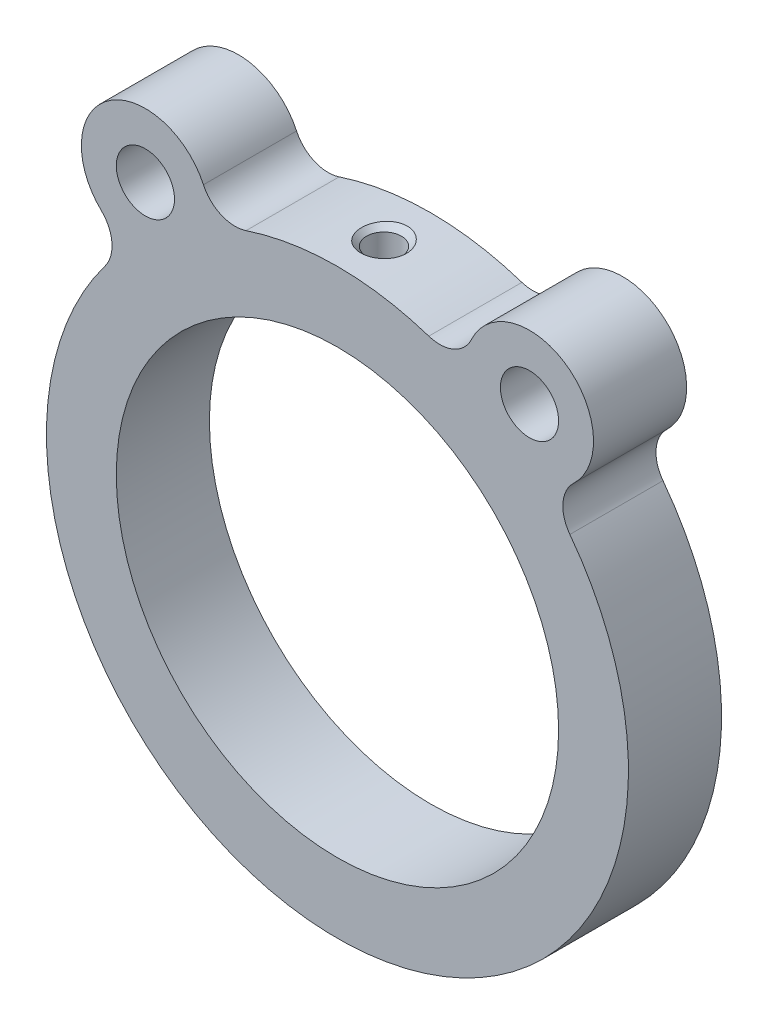
ISO-10303-21;
HEADER;
FILE_DESCRIPTION(('STEP AP214'),'2;1');
FILE_NAME('part.step','',(''),(''),'','','');
FILE_SCHEMA(('AUTOMOTIVE_DESIGN { 1 0 10303 214 1 1 1 1 }'));
ENDSEC;
DATA;
#1=APPLICATION_CONTEXT('core data for automotive mechanical design processes');
#2=APPLICATION_PROTOCOL_DEFINITION('international standard','automotive_design',2000,#1);
#3=PRODUCT_CONTEXT('',#1,'mechanical');
#4=PRODUCT('Part','Part','',(#3));
#5=PRODUCT_RELATED_PRODUCT_CATEGORY('part','',(#4));
#6=PRODUCT_DEFINITION_FORMATION('','',#4);
#7=PRODUCT_DEFINITION_CONTEXT('part definition',#1,'design');
#8=PRODUCT_DEFINITION('design','',#6,#7);
#9=PRODUCT_DEFINITION_SHAPE('','',#8);
#10=(LENGTH_UNIT() NAMED_UNIT(*) SI_UNIT(.MILLI.,.METRE.));
#11=(NAMED_UNIT(*) PLANE_ANGLE_UNIT() SI_UNIT($,.RADIAN.));
#12=(NAMED_UNIT(*) SI_UNIT($,.STERADIAN.) SOLID_ANGLE_UNIT());
#13=UNCERTAINTY_MEASURE_WITH_UNIT(LENGTH_MEASURE(1.E-05),#10,'distance_accuracy_value','');
#14=(GEOMETRIC_REPRESENTATION_CONTEXT(3) GLOBAL_UNCERTAINTY_ASSIGNED_CONTEXT((#13)) GLOBAL_UNIT_ASSIGNED_CONTEXT((#10,
#11,#12)) REPRESENTATION_CONTEXT('',''));
#15=CARTESIAN_POINT('',(0.,0.,0.));
#16=DIRECTION('',(0.,0.,1.));
#17=DIRECTION('',(1.,0.,0.));
#18=AXIS2_PLACEMENT_3D('',#15,#16,#17);
#19=CARTESIAN_POINT('',(-8.79240471556152,26.5837096605754,-4.));
#20=DIRECTION('',(0.,0.,1.));
#21=DIRECTION('',(1.,0.,0.));
#22=AXIS2_PLACEMENT_3D('',#19,#20,#21);
#23=CYLINDRICAL_SURFACE('',#22,3.);
#24=DIRECTION('',(0.,0.,1.));
#25=VECTOR('',#24,1.);
#26=CARTESIAN_POINT('',(-11.5127324630104,25.3188709568429,-4.));
#27=LINE('',#26,#25);
#28=CARTESIAN_POINT('',(-11.5127324630104,25.3188709568429,-4.));
#29=VERTEX_POINT('',#28);
#30=CARTESIAN_POINT('',(-11.5127324630104,25.3188709568429,4.));
#31=VERTEX_POINT('',#30);
#32=EDGE_CURVE('E120',#29,#31,#27,.T.);
#33=ORIENTED_EDGE('',*,*,#32,.T.);
#34=CARTESIAN_POINT('',(-8.79240471556152,26.5837096605754,4.));
#35=DIRECTION('',(0.,0.,1.));
#36=DIRECTION('',(1.,0.,0.));
#37=AXIS2_PLACEMENT_3D('',#34,#35,#36);
#38=CIRCLE('',#37,3.);
#39=CARTESIAN_POINT('',(-7.85036135317993,23.7354550540852,4.));
#40=VERTEX_POINT('',#39);
#41=EDGE_CURVE('E123',#31,#40,#38,.T.);
#42=ORIENTED_EDGE('',*,*,#41,.T.);
#43=DIRECTION('',(0.,0.,1.));
#44=VECTOR('',#43,1.);
#45=CARTESIAN_POINT('',(-7.85036135317993,23.7354550540852,-4.));
#46=LINE('',#45,#44);
#47=CARTESIAN_POINT('',(-7.85036135317993,23.7354550540852,-4.));
#48=VERTEX_POINT('',#47);
#49=EDGE_CURVE('E61',#48,#40,#46,.T.);
#50=ORIENTED_EDGE('',*,*,#49,.F.);
#51=CARTESIAN_POINT('',(-8.79240471556152,26.5837096605754,-4.));
#52=DIRECTION('',(0.,0.,1.));
#53=DIRECTION('',(1.,0.,0.));
#54=AXIS2_PLACEMENT_3D('',#51,#52,#53);
#55=CIRCLE('',#54,3.);
#56=EDGE_CURVE('E68',#29,#48,#55,.T.);
#57=ORIENTED_EDGE('',*,*,#56,.F.);
#58=EDGE_LOOP('',(#33,#42,#50,#57));
#59=FACE_BOUND('',#58,.T.);
#60=ADVANCED_FACE('F47',(#59),#23,.F.);
#61=CARTESIAN_POINT('',(0.,0.,-4.));
#62=DIRECTION('',(0.,0.,1.));
#63=DIRECTION('',(1.,0.,0.));
#64=AXIS2_PLACEMENT_3D('',#61,#62,#63);
#65=CYLINDRICAL_SURFACE('',#64,25.);
#66=CARTESIAN_POINT('',(-1.38843010974731,24.9614154671045,-1.38542860972688));
#67=CARTESIAN_POINT('',(-1.45429793454577,24.9577518223364,-1.31422853395466));
#68=CARTESIAN_POINT('',(-1.51491865516553,24.9541184918379,-1.23814035663589));
#69=CARTESIAN_POINT('',(-1.62454468414856,24.9472218705402,-1.07793964803592));
#70=CARTESIAN_POINT('',(-1.67353970891014,24.9439589086744,-0.99382010408581));
#71=CARTESIAN_POINT('',(-1.7657849281638,24.9376118014175,-0.805587915157327));
#72=CARTESIAN_POINT('',(-1.80690031661354,24.9346375942488,-0.70041756795328));
#73=CARTESIAN_POINT('',(-1.87140051363912,24.9298798807674,-0.484739942176894));
#74=CARTESIAN_POINT('',(-1.89477953577936,24.9280967630666,-0.374230934379203));
#75=CARTESIAN_POINT('',(-1.92363344715744,24.925887257572,-0.148188546922309));
#76=CARTESIAN_POINT('',(-1.92866685393591,24.9254943307857,-0.0325982116153125));
#77=CARTESIAN_POINT('',(-1.91948554378553,24.9262029636298,0.19781071683945));
#78=CARTESIAN_POINT('',(-1.90527025447947,24.9273045677012,0.312629286936056));
#79=CARTESIAN_POINT('',(-1.85771950616719,24.9308934345965,0.539192716934517));
#80=CARTESIAN_POINT('',(-1.82423084304796,24.933391795643,0.650905338745798));
#81=CARTESIAN_POINT('',(-1.73879665932032,24.9394949769286,0.867016586301364));
#82=CARTESIAN_POINT('',(-1.68685124803656,24.9430997906137,0.971415255363921));
#83=CARTESIAN_POINT('',(-1.56646899928733,24.9509470303338,1.16856366272785));
#84=CARTESIAN_POINT('',(-1.49822874049673,24.9551816447478,1.26143358706966));
#85=CARTESIAN_POINT('',(-1.34668012361719,24.9638176798685,1.43394194572168));
#86=CARTESIAN_POINT('',(-1.26337411351827,24.9682190744982,1.51358243812703));
#87=CARTESIAN_POINT('',(-1.0866525267161,24.976524220639,1.65475876482627));
#88=CARTESIAN_POINT('',(-0.993612363611554,24.980438895945,1.71676354411993));
#89=CARTESIAN_POINT('',(-0.798097982720414,24.9874485324203,1.8235619610644));
#90=CARTESIAN_POINT('',(-0.695626135538064,24.9905436988148,1.86835990899744));
#91=CARTESIAN_POINT('',(-0.488371265812186,24.9954360022362,1.93771446067499));
#92=CARTESIAN_POINT('',(-0.383825887264937,24.9972781891824,1.96297862427251));
#93=CARTESIAN_POINT('',(-0.17193501648651,24.999633013644,1.99510537976769));
#94=CARTESIAN_POINT('',(-0.0645900493297553,25.0001458986897,2.00197139760662));
#95=CARTESIAN_POINT('',(0.146800890801465,24.9997865920041,1.99711715735622));
#96=CARTESIAN_POINT('',(0.250858569754043,24.9989509333938,1.98588714699941));
#97=CARTESIAN_POINT('',(0.455598629109989,24.9960579997683,1.94616252235443));
#98=CARTESIAN_POINT('',(0.556281096751086,24.9940007563525,1.91766835464964));
#99=CARTESIAN_POINT('',(0.751562950408507,24.98889175667,1.84437586695549));
#100=CARTESIAN_POINT('',(0.846158085927066,24.9858393143344,1.79956629697867));
#101=CARTESIAN_POINT('',(1.02673399151959,24.9790711256239,1.69511395502983));
#102=CARTESIAN_POINT('',(1.11271381133365,24.9753553062049,1.6354695493126));
#103=CARTESIAN_POINT('',(1.27611917377163,24.9675469140965,1.50140190212929));
#104=CARTESIAN_POINT('',(1.35325594396933,24.9634469435824,1.42662739853191));
#105=CARTESIAN_POINT('',(1.49442443372117,24.9553943538353,1.26558982571308));
#106=CARTESIAN_POINT('',(1.55845386369849,24.9514417604444,1.17932475366761));
#107=CARTESIAN_POINT('',(1.67409890424333,24.9439549003817,0.994320404300172));
#108=CARTESIAN_POINT('',(1.72516531080806,24.9404416156022,0.895236885985037));
#109=CARTESIAN_POINT('',(1.81052972493888,24.9343903202022,0.690065339602644));
#110=CARTESIAN_POINT('',(1.84482500038189,24.9318524685002,0.583976173464141));
#111=CARTESIAN_POINT('',(1.89668265881625,24.9279622283365,0.36433872854194));
#112=CARTESIAN_POINT('',(1.91370355738033,24.9266483023783,0.250661676953384));
#113=CARTESIAN_POINT('',(1.92876691781171,24.9254872653056,0.0220452715314571));
#114=CARTESIAN_POINT('',(1.9268074072236,24.9256403066391,-0.092894212254839));
#115=CARTESIAN_POINT('',(1.9037883474786,24.9274091104999,-0.322471285245161));
#116=CARTESIAN_POINT('',(1.88246144233827,24.9290453471264,-0.437082056996947));
#117=CARTESIAN_POINT('',(1.82081934865818,24.9336231674514,-0.661061575031441));
#118=CARTESIAN_POINT('',(1.78050382010938,24.9365647745237,-0.770430227410472));
#119=CARTESIAN_POINT('',(1.68209705613917,24.9433950826763,-0.980136546399163));
#120=CARTESIAN_POINT('',(1.62409993865791,24.9472787474008,-1.08051847442439));
#121=CARTESIAN_POINT('',(1.49168364688542,24.9555457484372,-1.26978612161105));
#122=CARTESIAN_POINT('',(1.41726622372298,24.9599290314437,-1.35867306504282));
#123=CARTESIAN_POINT('',(1.25597324139614,24.9685577825635,-1.52000845237909));
#124=CARTESIAN_POINT('',(1.16944742124023,24.9728039968136,-1.59280616929048));
#125=CARTESIAN_POINT('',(0.984983849012787,24.9807586981632,-1.72217254679717));
#126=CARTESIAN_POINT('',(0.887048762753952,24.9844673104226,-1.77874498782987));
#127=CARTESIAN_POINT('',(0.686470078103515,24.9907670923137,-1.87180900069342));
#128=CARTESIAN_POINT('',(0.584139005661903,24.9933948277215,-1.90897172771205));
#129=CARTESIAN_POINT('',(0.374561901245703,24.997413253192,-1.96497222038236));
#130=CARTESIAN_POINT('',(0.267317089980449,24.9988042487617,-1.98381451176948));
#131=CARTESIAN_POINT('',(0.0547181397297122,25.0001587942169,-2.0021622812772));
#132=CARTESIAN_POINT('',(-0.0505833682825598,25.0001674767928,-2.00227914767056));
#133=CARTESIAN_POINT('',(-0.259690595456118,24.9988698146133,-1.98470333600606));
#134=CARTESIAN_POINT('',(-0.363496217285861,24.9975633846771,-1.96700950433453));
#135=CARTESIAN_POINT('',(-0.565757719942908,24.9938007458487,-1.91467510981907));
#136=CARTESIAN_POINT('',(-0.664251563674998,24.9913544012188,-1.88017982476418));
#137=CARTESIAN_POINT('',(-0.854149060944219,24.9855848763253,-1.79548413881126));
#138=CARTESIAN_POINT('',(-0.945556989738515,24.9822622301869,-1.74529330125301));
#139=CARTESIAN_POINT('',(-1.09746298428397,24.975985532235,-1.64505330905546));
#140=CARTESIAN_POINT('',(-1.16000615192743,24.973144300059,-1.59805353588761));
#141=CARTESIAN_POINT('',(-1.27897538524831,24.9673339622132,-1.49690009832342));
#142=CARTESIAN_POINT('',(-1.33540309395901,24.9643648911907,-1.44274836415409));
#143=CARTESIAN_POINT('',(-1.38843010974731,24.9614154671045,-1.38542860972688));
#144=B_SPLINE_CURVE_WITH_KNOTS('',3,(#66,#67,#68,#69,#70,#71,#72,#73,#74,#75,#76,#77,#78,#79,
#80,#81,#82,#83,#84,#85,#86,#87,#88,#89,#90,#91,#92,#93,#94,#95,#96,#97,#98,#99,#100,#101,#102,
#103,#104,#105,#106,#107,#108,#109,#110,#111,#112,#113,#114,#115,#116,#117,#118,#119,#120,#121,
#122,#123,#124,#125,#126,#127,#128,#129,#130,#131,#132,#133,#134,#135,#136,#137,#138,#139,#140,
#141,#142,#143),.UNSPECIFIED.,.T.,.F.,(4,2,2,2,2,2,2,2,2,2,2,2,2,2,2,2,2,2,2,2,2,2,2,2,2,2,2,2,
2,2,2,2,2,2,2,2,2,2,4),(0.,0.290975026474555,0.58220648565034,0.919507521928941,
1.25691855437872,1.60239760136811,1.94788692171181,2.29616123385506,2.64443348310326,
2.98869946935369,3.3329118480826,3.6668628290787,4.00073010127569,4.32184937112951,
4.64290884081377,4.95541560193379,5.26791427958,5.58062884431244,5.89337786323902,
6.21445536096815,6.5355888964185,6.86864622391132,7.20175779048448,7.54501559856377,
7.88830907858127,8.23641478702973,8.58452672887276,8.93081712231981,9.27707060377145,
9.61484419432997,9.9525390206678,10.2776197833376,10.6026202202099,10.9170071019795,
11.2314143481587,11.5431500041956,11.8546960877822,12.0890091876357,12.3232591779774),.UNSPECIFIED.);
#145=CARTESIAN_POINT('',(-1.38843010974731,24.9614154671045,-1.38542860972688));
#146=VERTEX_POINT('',#145);
#147=EDGE_CURVE('E11',#146,#146,#144,.T.);
#148=ORIENTED_EDGE('',*,*,#147,.F.);
#149=EDGE_LOOP('',(#148));
#150=FACE_BOUND('',#149,.T.);
#151=ORIENTED_EDGE('',*,*,#49,.T.);
#152=CARTESIAN_POINT('',(0.,0.,4.));
#153=DIRECTION('',(0.,0.,1.));
#154=DIRECTION('',(1.,0.,0.));
#155=AXIS2_PLACEMENT_3D('',#152,#153,#154);
#156=CIRCLE('',#155,25.);
#157=CARTESIAN_POINT('',(7.85036135317993,23.7354550540852,4.));
#158=VERTEX_POINT('',#157);
#159=EDGE_CURVE('E144',#158,#40,#156,.T.);
#160=ORIENTED_EDGE('',*,*,#159,.F.);
#161=DIRECTION('',(0.,0.,1.));
#162=VECTOR('',#161,1.);
#163=CARTESIAN_POINT('',(7.85036135317993,23.7354550540852,-4.));
#164=LINE('',#163,#162);
#165=CARTESIAN_POINT('',(7.85036135317993,23.7354550540852,-4.));
#166=VERTEX_POINT('',#165);
#167=EDGE_CURVE('E76',#166,#158,#164,.T.);
#168=ORIENTED_EDGE('',*,*,#167,.F.);
#169=CARTESIAN_POINT('',(0.,0.,-4.));
#170=DIRECTION('',(0.,0.,1.));
#171=DIRECTION('',(1.,0.,0.));
#172=AXIS2_PLACEMENT_3D('',#169,#170,#171);
#173=CIRCLE('',#172,25.);
#174=EDGE_CURVE('E206',#166,#48,#173,.T.);
#175=ORIENTED_EDGE('',*,*,#174,.T.);
#176=EDGE_LOOP('',(#151,#160,#168,#175));
#177=FACE_BOUND('',#176,.T.);
#178=ADVANCED_FACE('F242',(#150,#177),#65,.T.);
#179=CARTESIAN_POINT('',(8.79240471556153,26.5837096605754,-4.));
#180=DIRECTION('',(0.,0.,1.));
#181=DIRECTION('',(1.,0.,0.));
#182=AXIS2_PLACEMENT_3D('',#179,#180,#181);
#183=CYLINDRICAL_SURFACE('',#182,3.);
#184=ORIENTED_EDGE('',*,*,#167,.T.);
#185=CARTESIAN_POINT('',(8.79240471556153,26.5837096605754,4.));
#186=DIRECTION('',(0.,0.,1.));
#187=DIRECTION('',(1.,0.,0.));
#188=AXIS2_PLACEMENT_3D('',#185,#186,#187);
#189=CIRCLE('',#188,3.);
#190=CARTESIAN_POINT('',(11.5127324630104,25.3188709568429,4.));
#191=VERTEX_POINT('',#190);
#192=EDGE_CURVE('E166',#158,#191,#189,.T.);
#193=ORIENTED_EDGE('',*,*,#192,.T.);
#194=DIRECTION('',(0.,0.,1.));
#195=VECTOR('',#194,1.);
#196=CARTESIAN_POINT('',(11.5127324630104,25.3188709568429,-4.));
#197=LINE('',#196,#195);
#198=CARTESIAN_POINT('',(11.5127324630104,25.3188709568429,-4.));
#199=VERTEX_POINT('',#198);
#200=EDGE_CURVE('E224',#199,#191,#197,.T.);
#201=ORIENTED_EDGE('',*,*,#200,.F.);
#202=CARTESIAN_POINT('',(8.79240471556153,26.5837096605754,-4.));
#203=DIRECTION('',(0.,0.,1.));
#204=DIRECTION('',(1.,0.,0.));
#205=AXIS2_PLACEMENT_3D('',#202,#203,#204);
#206=CIRCLE('',#205,3.);
#207=EDGE_CURVE('E203',#166,#199,#206,.T.);
#208=ORIENTED_EDGE('',*,*,#207,.F.);
#209=EDGE_LOOP('',(#184,#193,#201,#208));
#210=FACE_BOUND('',#209,.T.);
#211=ADVANCED_FACE('F280',(#210),#183,.F.);
#212=CARTESIAN_POINT('',(16.5,23.,-4.));
#213=DIRECTION('',(0.,0.,1.));
#214=DIRECTION('',(1.,0.,0.));
#215=AXIS2_PLACEMENT_3D('',#212,#213,#214);
#216=CYLINDRICAL_SURFACE('',#215,5.5);
#217=ORIENTED_EDGE('',*,*,#200,.T.);
#218=CARTESIAN_POINT('',(16.5,23.,4.));
#219=DIRECTION('',(0.,0.,1.));
#220=DIRECTION('',(1.,0.,0.));
#221=AXIS2_PLACEMENT_3D('',#218,#219,#220);
#222=CIRCLE('',#221,5.5);
#223=CARTESIAN_POINT('',(20.2947007754956,19.0187632544079,4.));
#224=VERTEX_POINT('',#223);
#225=EDGE_CURVE('E162',#224,#191,#222,.T.);
#226=ORIENTED_EDGE('',*,*,#225,.F.);
#227=DIRECTION('',(0.,0.,1.));
#228=VECTOR('',#227,1.);
#229=CARTESIAN_POINT('',(20.2947007754956,19.0187632544079,-4.));
#230=LINE('',#229,#228);
#231=CARTESIAN_POINT('',(20.2947007754956,19.0187632544079,-4.));
#232=VERTEX_POINT('',#231);
#233=EDGE_CURVE('E227',#232,#224,#230,.T.);
#234=ORIENTED_EDGE('',*,*,#233,.F.);
#235=CARTESIAN_POINT('',(16.5,23.,-4.));
#236=DIRECTION('',(0.,0.,1.));
#237=DIRECTION('',(1.,0.,0.));
#238=AXIS2_PLACEMENT_3D('',#235,#236,#237);
#239=CIRCLE('',#238,5.5);
#240=EDGE_CURVE('E199',#232,#199,#239,.T.);
#241=ORIENTED_EDGE('',*,*,#240,.T.);
#242=EDGE_LOOP('',(#217,#226,#234,#241));
#243=FACE_BOUND('',#242,.T.);
#244=ADVANCED_FACE('F284',(#243),#216,.T.);
#245=CARTESIAN_POINT('',(22.3645375621296,16.847179574994,-4.));
#246=DIRECTION('',(0.,0.,1.));
#247=DIRECTION('',(1.,0.,0.));
#248=AXIS2_PLACEMENT_3D('',#245,#246,#247);
#249=CYLINDRICAL_SURFACE('',#248,3.);
#250=ORIENTED_EDGE('',*,*,#233,.T.);
#251=CARTESIAN_POINT('',(22.3645375621296,16.847179574994,4.));
#252=DIRECTION('',(0.,0.,1.));
#253=DIRECTION('',(1.,0.,0.));
#254=AXIS2_PLACEMENT_3D('',#251,#252,#253);
#255=CIRCLE('',#254,3.);
#256=CARTESIAN_POINT('',(19.9683371090443,15.0421246205303,4.));
#257=VERTEX_POINT('',#256);
#258=EDGE_CURVE('E158',#224,#257,#255,.T.);
#259=ORIENTED_EDGE('',*,*,#258,.T.);
#260=DIRECTION('',(0.,0.,1.));
#261=VECTOR('',#260,1.);
#262=CARTESIAN_POINT('',(19.9683371090443,15.0421246205303,-4.));
#263=LINE('',#262,#261);
#264=CARTESIAN_POINT('',(19.9683371090443,15.0421246205303,-4.));
#265=VERTEX_POINT('',#264);
#266=EDGE_CURVE('E230',#265,#257,#263,.T.);
#267=ORIENTED_EDGE('',*,*,#266,.F.);
#268=CARTESIAN_POINT('',(22.3645375621296,16.847179574994,-4.));
#269=DIRECTION('',(0.,0.,1.));
#270=DIRECTION('',(1.,0.,0.));
#271=AXIS2_PLACEMENT_3D('',#268,#269,#270);
#272=CIRCLE('',#271,3.);
#273=EDGE_CURVE('E196',#232,#265,#272,.T.);
#274=ORIENTED_EDGE('',*,*,#273,.F.);
#275=EDGE_LOOP('',(#250,#259,#267,#274));
#276=FACE_BOUND('',#275,.T.);
#277=ADVANCED_FACE('F296',(#276),#249,.F.);
#278=CARTESIAN_POINT('',(0.,0.,-4.));
#279=DIRECTION('',(0.,0.,1.));
#280=DIRECTION('',(1.,0.,0.));
#281=AXIS2_PLACEMENT_3D('',#278,#279,#280);
#282=CYLINDRICAL_SURFACE('',#281,25.);
#283=ORIENTED_EDGE('',*,*,#266,.T.);
#284=CARTESIAN_POINT('',(0.,0.,4.));
#285=DIRECTION('',(0.,0.,1.));
#286=DIRECTION('',(1.,0.,0.));
#287=AXIS2_PLACEMENT_3D('',#284,#285,#286);
#288=CIRCLE('',#287,25.);
#289=CARTESIAN_POINT('',(-19.9683371090443,15.0421246205303,4.));
#290=VERTEX_POINT('',#289);
#291=EDGE_CURVE('E154',#290,#257,#288,.T.);
#292=ORIENTED_EDGE('',*,*,#291,.F.);
#293=DIRECTION('',(0.,0.,1.));
#294=VECTOR('',#293,1.);
#295=CARTESIAN_POINT('',(-19.9683371090443,15.0421246205303,-4.));
#296=LINE('',#295,#294);
#297=CARTESIAN_POINT('',(-19.9683371090443,15.0421246205303,-4.));
#298=VERTEX_POINT('',#297);
#299=EDGE_CURVE('E233',#298,#290,#296,.T.);
#300=ORIENTED_EDGE('',*,*,#299,.F.);
#301=CARTESIAN_POINT('',(0.,0.,-4.));
#302=DIRECTION('',(0.,0.,1.));
#303=DIRECTION('',(1.,0.,0.));
#304=AXIS2_PLACEMENT_3D('',#301,#302,#303);
#305=CIRCLE('',#304,25.);
#306=EDGE_CURVE('E192',#298,#265,#305,.T.);
#307=ORIENTED_EDGE('',*,*,#306,.T.);
#308=EDGE_LOOP('',(#283,#292,#300,#307));
#309=FACE_BOUND('',#308,.T.);
#310=ADVANCED_FACE('F300',(#309),#282,.T.);
#311=CARTESIAN_POINT('',(-22.3645375621296,16.847179574994,-4.));
#312=DIRECTION('',(0.,0.,1.));
#313=DIRECTION('',(1.,0.,0.));
#314=AXIS2_PLACEMENT_3D('',#311,#312,#313);
#315=CYLINDRICAL_SURFACE('',#314,3.);
#316=ORIENTED_EDGE('',*,*,#299,.T.);
#317=CARTESIAN_POINT('',(-22.3645375621296,16.847179574994,4.));
#318=DIRECTION('',(0.,0.,1.));
#319=DIRECTION('',(1.,0.,0.));
#320=AXIS2_PLACEMENT_3D('',#317,#318,#319);
#321=CIRCLE('',#320,3.);
#322=CARTESIAN_POINT('',(-20.2947007754956,19.0187632544079,4.));
#323=VERTEX_POINT('',#322);
#324=EDGE_CURVE('E138',#290,#323,#321,.T.);
#325=ORIENTED_EDGE('',*,*,#324,.T.);
#326=DIRECTION('',(0.,0.,1.));
#327=VECTOR('',#326,1.);
#328=CARTESIAN_POINT('',(-20.2947007754956,19.0187632544079,-4.));
#329=LINE('',#328,#327);
#330=CARTESIAN_POINT('',(-20.2947007754956,19.0187632544079,-4.));
#331=VERTEX_POINT('',#330);
#332=EDGE_CURVE('E127',#331,#323,#329,.T.);
#333=ORIENTED_EDGE('',*,*,#332,.F.);
#334=CARTESIAN_POINT('',(-22.3645375621296,16.847179574994,-4.));
#335=DIRECTION('',(0.,0.,1.));
#336=DIRECTION('',(1.,0.,0.));
#337=AXIS2_PLACEMENT_3D('',#334,#335,#336);
#338=CIRCLE('',#337,3.);
#339=EDGE_CURVE('E189',#298,#331,#338,.T.);
#340=ORIENTED_EDGE('',*,*,#339,.F.);
#341=EDGE_LOOP('',(#316,#325,#333,#340));
#342=FACE_BOUND('',#341,.T.);
#343=ADVANCED_FACE('F266',(#342),#315,.F.);
#344=CARTESIAN_POINT('',(-16.5,23.,-4.));
#345=DIRECTION('',(0.,0.,1.));
#346=DIRECTION('',(1.,0.,0.));
#347=AXIS2_PLACEMENT_3D('',#344,#345,#346);
#348=CYLINDRICAL_SURFACE('',#347,2.5);
#349=CARTESIAN_POINT('',(-16.5,23.,-4.));
#350=DIRECTION('',(0.,0.,1.));
#351=DIRECTION('',(1.,0.,0.));
#352=AXIS2_PLACEMENT_3D('',#349,#350,#351);
#353=CIRCLE('',#352,2.5);
#354=CARTESIAN_POINT('',(-14.,23.,-4.));
#355=VERTEX_POINT('',#354);
#356=EDGE_CURVE('E213',#355,#355,#353,.T.);
#357=ORIENTED_EDGE('',*,*,#356,.F.);
#358=EDGE_LOOP('',(#357));
#359=FACE_BOUND('',#358,.T.);
#360=CARTESIAN_POINT('',(-16.5,23.,4.));
#361=DIRECTION('',(0.,0.,1.));
#362=DIRECTION('',(1.,0.,0.));
#363=AXIS2_PLACEMENT_3D('',#360,#361,#362);
#364=CIRCLE('',#363,2.5);
#365=CARTESIAN_POINT('',(-14.,23.,4.));
#366=VERTEX_POINT('',#365);
#367=EDGE_CURVE('E176',#366,#366,#364,.T.);
#368=ORIENTED_EDGE('',*,*,#367,.T.);
#369=EDGE_LOOP('',(#368));
#370=FACE_BOUND('',#369,.T.);
#371=ADVANCED_FACE('F263',(#359,#370),#348,.F.);
#372=CARTESIAN_POINT('',(0.,0.,-4.));
#373=DIRECTION('',(0.,0.,1.));
#374=DIRECTION('',(1.,0.,0.));
#375=AXIS2_PLACEMENT_3D('',#372,#373,#374);
#376=CYLINDRICAL_SURFACE('',#375,19.);
#377=CARTESIAN_POINT('',(0.,19.,1.5));
#378=CARTESIAN_POINT('',(0.0841151387188531,18.999999221537,1.49999631934173));
#379=CARTESIAN_POINT('',(0.168287922827547,18.9994354600354,1.49290084958466));
#380=CARTESIAN_POINT('',(0.334305698598371,18.997240706404,1.46469947465167));
#381=CARTESIAN_POINT('',(0.416147925046005,18.9956084974586,1.44357759491472));
#382=CARTESIAN_POINT('',(0.575076027563787,18.9914613431667,1.38793703178533));
#383=CARTESIAN_POINT('',(0.652164524677552,18.9889468894701,1.3534258087611));
#384=CARTESIAN_POINT('',(0.799435680795711,18.9833174206842,1.27199926981773));
#385=CARTESIAN_POINT('',(0.869619836810093,18.9802025362166,1.22508665095823));
#386=CARTESIAN_POINT('',(1.00127051563136,18.9737138537755,1.12007204663659));
#387=CARTESIAN_POINT('',(1.06271896083146,18.9703395405387,1.06194742819675));
#388=CARTESIAN_POINT('',(1.1749989049417,18.9637166459802,0.936206408029781));
#389=CARTESIAN_POINT('',(1.22582994292754,18.960468070122,0.868589594439192));
#390=CARTESIAN_POINT('',(1.31549242293151,18.9544588143707,0.725675328414235));
#391=CARTESIAN_POINT('',(1.3543081273485,18.951698776369,0.650367973118572));
#392=CARTESIAN_POINT('',(1.41873755115466,18.9469848112354,0.494279424529938));
#393=CARTESIAN_POINT('',(1.4443514822562,18.9450308711765,0.413498319041155));
#394=CARTESIAN_POINT('',(1.48159822322926,18.9421545390237,0.248935339909821));
#395=CARTESIAN_POINT('',(1.49326029941243,18.9412299879009,0.165160128678885));
#396=CARTESIAN_POINT('',(1.50236268465663,18.9405102433779,-0.00316340857498989));
#397=CARTESIAN_POINT('',(1.49980323578884,18.9407150307546,-0.0877117214141508));
#398=CARTESIAN_POINT('',(1.48055943130006,18.9422288673013,-0.25498115501764));
#399=CARTESIAN_POINT('',(1.46390684932512,18.9435354324364,-0.337705956855368));
#400=CARTESIAN_POINT('',(1.41699882958061,18.9471017023429,-0.499182607561631));
#401=CARTESIAN_POINT('',(1.38674327091875,18.9493614155851,-0.577934421114529));
#402=CARTESIAN_POINT('',(1.31345245016364,18.9545822190074,-0.729331074859555));
#403=CARTESIAN_POINT('',(1.2704028956484,18.9575440928322,-0.801968967999393));
#404=CARTESIAN_POINT('',(1.17275641592226,18.9638347400174,-0.93899989395522));
#405=CARTESIAN_POINT('',(1.11815928117868,18.9671635200349,-1.00339277713015));
#406=CARTESIAN_POINT('',(0.998789069552184,18.9738239428695,-1.12229057948028));
#407=CARTESIAN_POINT('',(0.933988517197366,18.9771555685343,-1.17676791879317));
#408=CARTESIAN_POINT('',(0.796146882184882,18.9834375709718,-1.27407509939559));
#409=CARTESIAN_POINT('',(0.723105794733443,18.9863879475227,-1.31690493390936));
#410=CARTESIAN_POINT('',(0.570838809989568,18.991575496542,-1.38969946273513));
#411=CARTESIAN_POINT('',(0.491612346167745,18.9938126035852,-1.41966297696088));
#412=CARTESIAN_POINT('',(0.32923160634509,18.9973207725944,-1.46585520971451));
#413=CARTESIAN_POINT('',(0.246077403532174,18.9985918525535,-1.48208418405981));
#414=CARTESIAN_POINT('',(0.0784407393713434,19.0000224384176,-1.5003121722034));
#415=CARTESIAN_POINT('',(-0.00603755448041773,19.0001849207592,-1.50234928955241));
#416=CARTESIAN_POINT('',(-0.174134501686998,18.9993879456588,-1.49223549471701));
#417=CARTESIAN_POINT('',(-0.25775316222124,18.9984284975946,-1.48008470112344));
#418=CARTESIAN_POINT('',(-0.421648876867876,18.9954975020934,-1.44197157489794));
#419=CARTESIAN_POINT('',(-0.501930053359409,18.9935272459175,-1.41602686183516));
#420=CARTESIAN_POINT('',(-0.656999501829891,18.9887960412095,-1.35108034355391));
#421=CARTESIAN_POINT('',(-0.73178769559667,18.9860350814215,-1.31207835246253));
#422=CARTESIAN_POINT('',(-0.873921875208902,18.9800247197833,-1.22202835520065));
#423=CARTESIAN_POINT('',(-0.941251793864613,18.976774297697,-1.17095505784873));
#424=CARTESIAN_POINT('',(-1.06639608992058,18.9701537726923,-1.05824883025555));
#425=CARTESIAN_POINT('',(-1.12421031888409,18.9667836679079,-0.996615735320938));
#426=CARTESIAN_POINT('',(-1.2288124248757,18.9602948383227,-0.864374324175827));
#427=CARTESIAN_POINT('',(-1.27557547077564,18.9571766897926,-0.793746334523397));
#428=CARTESIAN_POINT('',(-1.356577619136,18.9515527813904,-0.645618147208736));
#429=CARTESIAN_POINT('',(-1.39081683559962,18.9490470159439,-0.568118012110947));
#430=CARTESIAN_POINT('',(-1.44575693555034,18.94493468603,-0.408534049893585));
#431=CARTESIAN_POINT('',(-1.46647311943612,18.9433271056248,-0.326455517499475));
#432=CARTESIAN_POINT('',(-1.49382895011883,18.9411896745755,-0.159971925186588));
#433=CARTESIAN_POINT('',(-1.50046883646069,18.9406598055914,-0.0755669048838359));
#434=CARTESIAN_POINT('',(-1.49948094344338,18.9407380213103,0.09292692947146));
#435=CARTESIAN_POINT('',(-1.49189218322356,18.9413429939456,0.177015976500798));
#436=CARTESIAN_POINT('',(-1.46274366938461,18.9436161189885,0.342721436509554));
#437=CARTESIAN_POINT('',(-1.44118389337775,18.9452842730997,0.424337845526493));
#438=CARTESIAN_POINT('',(-1.38471500507715,18.9494949902263,0.582784498435053));
#439=CARTESIAN_POINT('',(-1.34980648222261,18.9520375146316,0.659614953485353));
#440=CARTESIAN_POINT('',(-1.267635548191,18.9577105355609,0.806330890474431));
#441=CARTESIAN_POINT('',(-1.22037336027397,18.9608410214587,0.87621649789158));
#442=CARTESIAN_POINT('',(-1.11469031191135,18.967347409111,1.007258401442));
#443=CARTESIAN_POINT('',(-1.05624065477126,18.9707239299605,1.06839144257716));
#444=CARTESIAN_POINT('',(-0.929892124489481,18.977336317951,1.18000278065208));
#445=CARTESIAN_POINT('',(-0.861990962632757,18.9805721507741,1.23047848940779));
#446=CARTESIAN_POINT('',(-0.718548782250667,18.9865438065605,1.31940271283775));
#447=CARTESIAN_POINT('',(-0.642994879159652,18.989278763737,1.35783048218647));
#448=CARTESIAN_POINT('',(-0.486538032284915,18.9939300983643,1.42140600094975));
#449=CARTESIAN_POINT('',(-0.405641386546966,18.9958474204367,1.44656908316626));
#450=CARTESIAN_POINT('',(-0.270219385273124,18.9981528412889,1.47646148286017));
#451=CARTESIAN_POINT('',(-0.216566049108645,18.9988423900528,1.48527676958514));
#452=CARTESIAN_POINT('',(-0.108616487728126,18.9997662202352,1.4970472097532));
#453=CARTESIAN_POINT('',(-0.0543202640171314,19.0000005027195,1.50000237691255));
#454=CARTESIAN_POINT('',(0.,19.,1.5));
#455=B_SPLINE_CURVE_WITH_KNOTS('',3,(#377,#378,#379,#380,#381,#382,#383,#384,#385,#386,#387,
#388,#389,#390,#391,#392,#393,#394,#395,#396,#397,#398,#399,#400,#401,#402,#403,#404,#405,#406,
#407,#408,#409,#410,#411,#412,#413,#414,#415,#416,#417,#418,#419,#420,#421,#422,#423,#424,#425,
#426,#427,#428,#429,#430,#431,#432,#433,#434,#435,#436,#437,#438,#439,#440,#441,#442,#443,#444,
#445,#446,#447,#448,#449,#450,#451,#452,#453,#454),.UNSPECIFIED.,.T.,.F.,(4,2,2,2,2,2,2,2,2,2,2,
2,2,2,2,2,2,2,2,2,2,2,2,2,2,2,2,2,2,2,2,2,2,2,2,2,2,2,4),(0.,0.25214709427337,0.504581850393632,
0.756876154680069,1.00911563499451,1.26186972745745,1.5146347902352,1.76772953561851,
2.02082022208066,2.2733790730491,2.52593362510897,2.77792029301404,3.02990920041797,
3.28218067450636,3.53445672649364,3.78742409874194,4.0403916181499,4.29338233453674,
4.54636833865406,4.7986748409289,5.05097923429393,5.30296211992512,5.55494859273474,
5.80746776930198,6.0599908845826,6.31307611620289,6.56615904395591,6.81895512684884,
7.07174690772233,7.32384647280325,7.57594644186005,7.82803528025069,8.08011956311294,
8.33286165921679,8.58566506452424,8.83890141074387,9.091844392762,9.25467749271782,
9.41751021154459),.UNSPECIFIED.);
#456=CARTESIAN_POINT('',(0.,19.,1.5));
#457=VERTEX_POINT('',#456);
#458=EDGE_CURVE('E50',#457,#457,#455,.T.);
#459=ORIENTED_EDGE('',*,*,#458,.T.);
#460=EDGE_LOOP('',(#459));
#461=FACE_BOUND('',#460,.T.);
#462=CARTESIAN_POINT('',(0.,0.,-4.));
#463=DIRECTION('',(0.,0.,1.));
#464=DIRECTION('',(1.,0.,0.));
#465=AXIS2_PLACEMENT_3D('',#462,#463,#464);
#466=CIRCLE('',#465,19.);
#467=CARTESIAN_POINT('',(19.,0.,-4.));
#468=VERTEX_POINT('',#467);
#469=EDGE_CURVE('E209',#468,#468,#466,.T.);
#470=ORIENTED_EDGE('',*,*,#469,.F.);
#471=EDGE_LOOP('',(#470));
#472=FACE_BOUND('',#471,.T.);
#473=CARTESIAN_POINT('',(0.,0.,4.));
#474=DIRECTION('',(0.,0.,1.));
#475=DIRECTION('',(1.,0.,0.));
#476=AXIS2_PLACEMENT_3D('',#473,#474,#475);
#477=CIRCLE('',#476,19.);
#478=CARTESIAN_POINT('',(19.,0.,4.));
#479=VERTEX_POINT('',#478);
#480=EDGE_CURVE('E172',#479,#479,#477,.T.);
#481=ORIENTED_EDGE('',*,*,#480,.T.);
#482=EDGE_LOOP('',(#481));
#483=FACE_BOUND('',#482,.T.);
#484=ADVANCED_FACE('F265',(#461,#472,#483),#376,.F.);
#485=CARTESIAN_POINT('',(-16.5,23.,-4.));
#486=DIRECTION('',(0.,0.,1.));
#487=DIRECTION('',(1.,0.,0.));
#488=AXIS2_PLACEMENT_3D('',#485,#486,#487);
#489=CYLINDRICAL_SURFACE('',#488,5.5);
#490=ORIENTED_EDGE('',*,*,#332,.T.);
#491=CARTESIAN_POINT('',(-16.5,23.,4.));
#492=DIRECTION('',(0.,0.,1.));
#493=DIRECTION('',(1.,0.,0.));
#494=AXIS2_PLACEMENT_3D('',#491,#492,#493);
#495=CIRCLE('',#494,5.5);
#496=EDGE_CURVE('E131',#31,#323,#495,.T.);
#497=ORIENTED_EDGE('',*,*,#496,.F.);
#498=ORIENTED_EDGE('',*,*,#32,.F.);
#499=CARTESIAN_POINT('',(-16.5,23.,-4.));
#500=DIRECTION('',(0.,0.,1.));
#501=DIRECTION('',(1.,0.,0.));
#502=AXIS2_PLACEMENT_3D('',#499,#500,#501);
#503=CIRCLE('',#502,5.5);
#504=EDGE_CURVE('E186',#29,#331,#503,.T.);
#505=ORIENTED_EDGE('',*,*,#504,.T.);
#506=EDGE_LOOP('',(#490,#497,#498,#505));
#507=FACE_BOUND('',#506,.T.);
#508=ADVANCED_FACE('F132',(#507),#489,.T.);
#509=CARTESIAN_POINT('',(16.5,23.,-4.));
#510=DIRECTION('',(0.,0.,1.));
#511=DIRECTION('',(1.,0.,0.));
#512=AXIS2_PLACEMENT_3D('',#509,#510,#511);
#513=CYLINDRICAL_SURFACE('',#512,2.5);
#514=CARTESIAN_POINT('',(16.5,23.,-4.));
#515=DIRECTION('',(0.,0.,1.));
#516=DIRECTION('',(1.,0.,0.));
#517=AXIS2_PLACEMENT_3D('',#514,#515,#516);
#518=CIRCLE('',#517,2.5);
#519=CARTESIAN_POINT('',(19.,23.,-4.));
#520=VERTEX_POINT('',#519);
#521=EDGE_CURVE('E128',#520,#520,#518,.T.);
#522=ORIENTED_EDGE('',*,*,#521,.F.);
#523=EDGE_LOOP('',(#522));
#524=FACE_BOUND('',#523,.T.);
#525=CARTESIAN_POINT('',(16.5,23.,4.));
#526=DIRECTION('',(0.,0.,1.));
#527=DIRECTION('',(1.,0.,0.));
#528=AXIS2_PLACEMENT_3D('',#525,#526,#527);
#529=CIRCLE('',#528,2.5);
#530=CARTESIAN_POINT('',(19.,23.,4.));
#531=VERTEX_POINT('',#530);
#532=EDGE_CURVE('E180',#531,#531,#529,.T.);
#533=ORIENTED_EDGE('',*,*,#532,.T.);
#534=EDGE_LOOP('',(#533));
#535=FACE_BOUND('',#534,.T.);
#536=ADVANCED_FACE('F259',(#524,#535),#513,.F.);
#537=CARTESIAN_POINT('',(0.,0.,-4.));
#538=DIRECTION('',(0.,0.,1.));
#539=DIRECTION('',(1.,0.,0.));
#540=AXIS2_PLACEMENT_3D('',#537,#538,#539);
#541=PLANE('',#540);
#542=ORIENTED_EDGE('',*,*,#56,.T.);
#543=ORIENTED_EDGE('',*,*,#174,.F.);
#544=ORIENTED_EDGE('',*,*,#207,.T.);
#545=ORIENTED_EDGE('',*,*,#240,.F.);
#546=ORIENTED_EDGE('',*,*,#273,.T.);
#547=ORIENTED_EDGE('',*,*,#306,.F.);
#548=ORIENTED_EDGE('',*,*,#339,.T.);
#549=ORIENTED_EDGE('',*,*,#504,.F.);
#550=EDGE_LOOP('',(#542,#543,#544,#545,#546,#547,#548,#549));
#551=FACE_BOUND('',#550,.T.);
#552=ORIENTED_EDGE('',*,*,#469,.T.);
#553=EDGE_LOOP('',(#552));
#554=FACE_BOUND('',#553,.T.);
#555=ORIENTED_EDGE('',*,*,#356,.T.);
#556=EDGE_LOOP('',(#555));
#557=FACE_BOUND('',#556,.T.);
#558=ORIENTED_EDGE('',*,*,#521,.T.);
#559=EDGE_LOOP('',(#558));
#560=FACE_BOUND('',#559,.T.);
#561=ADVANCED_FACE('F256',(#551,#554,#557,#560),#541,.F.);
#562=CARTESIAN_POINT('',(0.,0.,4.));
#563=DIRECTION('',(0.,0.,1.));
#564=DIRECTION('',(1.,0.,0.));
#565=AXIS2_PLACEMENT_3D('',#562,#563,#564);
#566=PLANE('',#565);
#567=ORIENTED_EDGE('',*,*,#41,.F.);
#568=ORIENTED_EDGE('',*,*,#496,.T.);
#569=ORIENTED_EDGE('',*,*,#324,.F.);
#570=ORIENTED_EDGE('',*,*,#291,.T.);
#571=ORIENTED_EDGE('',*,*,#258,.F.);
#572=ORIENTED_EDGE('',*,*,#225,.T.);
#573=ORIENTED_EDGE('',*,*,#192,.F.);
#574=ORIENTED_EDGE('',*,*,#159,.T.);
#575=EDGE_LOOP('',(#567,#568,#569,#570,#571,#572,#573,#574));
#576=FACE_BOUND('',#575,.T.);
#577=ORIENTED_EDGE('',*,*,#480,.F.);
#578=EDGE_LOOP('',(#577));
#579=FACE_BOUND('',#578,.T.);
#580=ORIENTED_EDGE('',*,*,#367,.F.);
#581=EDGE_LOOP('',(#580));
#582=FACE_BOUND('',#581,.T.);
#583=ORIENTED_EDGE('',*,*,#532,.F.);
#584=EDGE_LOOP('',(#583));
#585=FACE_BOUND('',#584,.T.);
#586=ADVANCED_FACE('F141',(#576,#579,#582,#585),#566,.T.);
#587=CARTESIAN_POINT('',(0.,25.,0.));
#588=DIRECTION('',(0.,1.,0.));
#589=DIRECTION('',(0.,0.,1.));
#590=AXIS2_PLACEMENT_3D('',#587,#588,#589);
#591=CYLINDRICAL_SURFACE('',#590,1.5);
#592=CARTESIAN_POINT('',(0.,24.5,0.));
#593=DIRECTION('',(0.,1.,0.));
#594=DIRECTION('',(0.,0.,1.));
#595=AXIS2_PLACEMENT_3D('',#592,#593,#594);
#596=CIRCLE('',#595,1.5);
#597=CARTESIAN_POINT('',(0.,24.5,1.5));
#598=VERTEX_POINT('',#597);
#599=EDGE_CURVE('E149',#598,#598,#596,.T.);
#600=ORIENTED_EDGE('',*,*,#599,.T.);
#601=EDGE_LOOP('',(#600));
#602=FACE_BOUND('',#601,.T.);
#603=ORIENTED_EDGE('',*,*,#458,.F.);
#604=EDGE_LOOP('',(#603));
#605=FACE_BOUND('',#604,.T.);
#606=ADVANCED_FACE('F248',(#602,#605),#591,.F.);
#607=CARTESIAN_POINT('',(0.,25.,0.));
#608=DIRECTION('',(0.,1.,0.));
#609=DIRECTION('',(0.,0.,1.));
#610=AXIS2_PLACEMENT_3D('',#607,#608,#609);
#611=CONICAL_SURFACE('',#610,2.,0.785398163397449);
#612=ORIENTED_EDGE('',*,*,#147,.T.);
#613=EDGE_LOOP('',(#612));
#614=FACE_BOUND('',#613,.T.);
#615=ORIENTED_EDGE('',*,*,#599,.F.);
#616=EDGE_LOOP('',(#615));
#617=FACE_BOUND('',#616,.T.);
#618=ADVANCED_FACE('F245',(#614,#617),#611,.F.);
#619=CLOSED_SHELL('',(#60,#178,#211,#244,#277,#310,#343,#371,#484,#508,#536,#561,#586,#606,#618));
#620=MANIFOLD_SOLID_BREP('B2',#619);
#621=ADVANCED_BREP_SHAPE_REPRESENTATION('',(#18,#620),#14);
#622=SHAPE_DEFINITION_REPRESENTATION(#9,#621);
ENDSEC;
END-ISO-10303-21;
